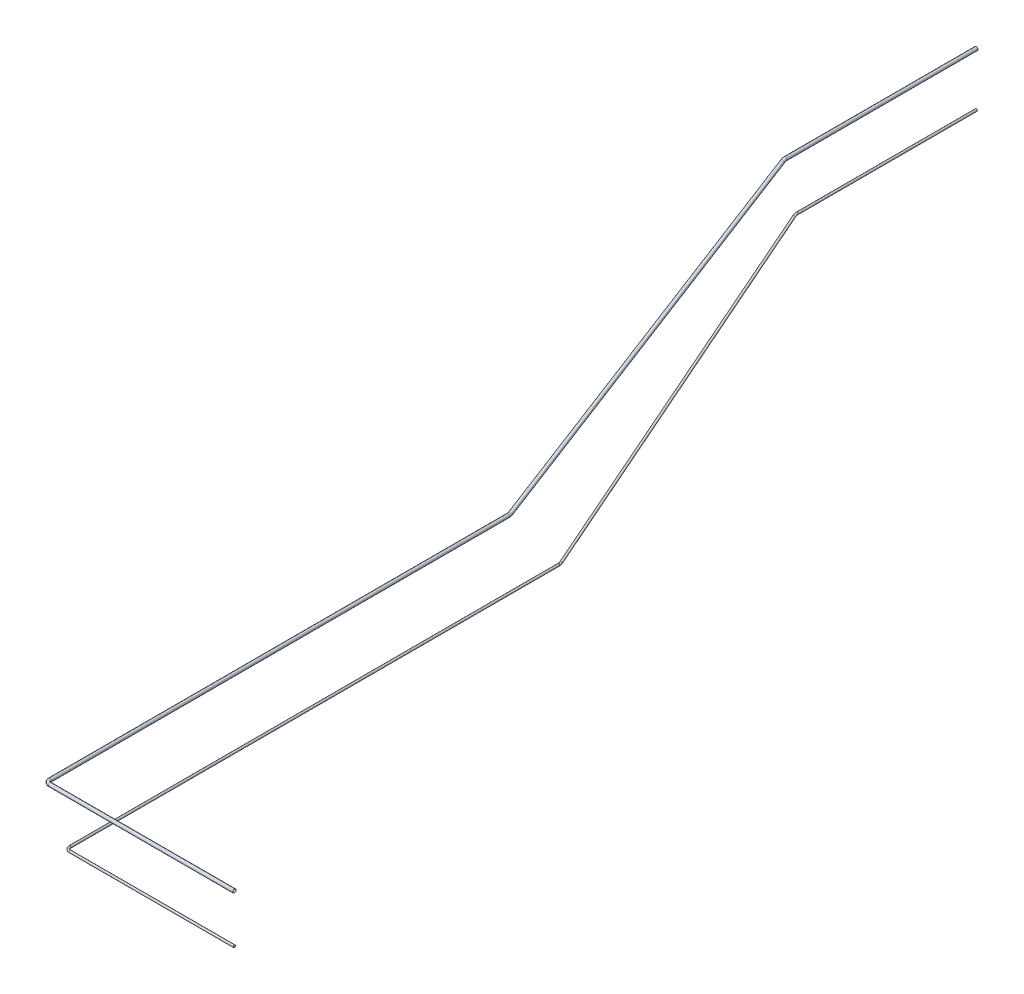
ISO-10303-21;
HEADER;
FILE_DESCRIPTION(('STEP AP214'),'2;1');
FILE_NAME('part.step','',(''),(''),'','','');
FILE_SCHEMA(('AUTOMOTIVE_DESIGN { 1 0 10303 214 1 1 1 1 }'));
ENDSEC;
DATA;
#1=APPLICATION_CONTEXT('core data for automotive mechanical design processes');
#2=APPLICATION_PROTOCOL_DEFINITION('international standard','automotive_design',2000,#1);
#3=PRODUCT_CONTEXT('',#1,'mechanical');
#4=PRODUCT('Part','Part','',(#3));
#5=PRODUCT_RELATED_PRODUCT_CATEGORY('part','',(#4));
#6=PRODUCT_DEFINITION_FORMATION('','',#4);
#7=PRODUCT_DEFINITION_CONTEXT('part definition',#1,'design');
#8=PRODUCT_DEFINITION('design','',#6,#7);
#9=PRODUCT_DEFINITION_SHAPE('','',#8);
#10=(LENGTH_UNIT() NAMED_UNIT(*) SI_UNIT(.MILLI.,.METRE.));
#11=(NAMED_UNIT(*) PLANE_ANGLE_UNIT() SI_UNIT($,.RADIAN.));
#12=(NAMED_UNIT(*) SI_UNIT($,.STERADIAN.) SOLID_ANGLE_UNIT());
#13=UNCERTAINTY_MEASURE_WITH_UNIT(LENGTH_MEASURE(1.E-05),#10,'distance_accuracy_value','');
#14=(GEOMETRIC_REPRESENTATION_CONTEXT(3) GLOBAL_UNCERTAINTY_ASSIGNED_CONTEXT((#13)) GLOBAL_UNIT_ASSIGNED_CONTEXT((#10,
#11,#12)) REPRESENTATION_CONTEXT('',''));
#15=CARTESIAN_POINT('',(0.,0.,0.));
#16=DIRECTION('',(0.,0.,1.));
#17=DIRECTION('',(1.,0.,0.));
#18=AXIS2_PLACEMENT_3D('',#15,#16,#17);
#19=CARTESIAN_POINT('',(0.,1100.,0.));
#20=DIRECTION('',(-1.,0.,0.));
#21=DIRECTION('',(0.,0.,1.));
#22=AXIS2_PLACEMENT_3D('',#19,#20,#21);
#23=CYLINDRICAL_SURFACE('',#22,21.2000000000001);
#24=CARTESIAN_POINT('',(-2309.67841768229,1100.,0.));
#25=DIRECTION('',(1.,0.,0.));
#26=DIRECTION('',(0.,0.,-1.));
#27=AXIS2_PLACEMENT_3D('',#24,#25,#26);
#28=CIRCLE('',#27,21.2000000000001);
#29=CARTESIAN_POINT('',(-2309.67841768229,1100.,21.2));
#30=VERTEX_POINT('',#29);
#31=EDGE_CURVE('E63',#30,#30,#28,.T.);
#32=ORIENTED_EDGE('',*,*,#31,.T.);
#33=EDGE_LOOP('',(#32));
#34=FACE_BOUND('',#33,.T.);
#35=CARTESIAN_POINT('',(0.,1100.,0.));
#36=DIRECTION('',(1.,0.,0.));
#37=DIRECTION('',(0.,0.,-1.));
#38=AXIS2_PLACEMENT_3D('',#35,#36,#37);
#39=CIRCLE('',#38,21.2000000000001);
#40=CARTESIAN_POINT('',(0.,1100.,-21.2000000000001));
#41=VERTEX_POINT('',#40);
#42=EDGE_CURVE('E60',#41,#41,#39,.T.);
#43=ORIENTED_EDGE('',*,*,#42,.F.);
#44=EDGE_LOOP('',(#43));
#45=FACE_BOUND('',#44,.T.);
#46=ADVANCED_FACE('F39',(#34,#45),#23,.T.);
#47=CARTESIAN_POINT('',(-2309.67841768229,1100.,-49.999999999999));
#48=DIRECTION('',(0.,-1.,0.));
#49=DIRECTION('',(0.,0.,-1.));
#50=AXIS2_PLACEMENT_3D('',#47,#48,#49);
#51=TOROIDAL_SURFACE('',#50,49.999999999999,21.2000000000001);
#52=CARTESIAN_POINT('',(-2359.67841768229,1100.,-49.999999999999));
#53=DIRECTION('',(0.,0.,1.));
#54=DIRECTION('',(1.,0.,0.));
#55=AXIS2_PLACEMENT_3D('',#52,#53,#54);
#56=CIRCLE('',#55,21.2000000000001);
#57=CARTESIAN_POINT('',(-2380.87841768229,1100.,-49.999999999999));
#58=VERTEX_POINT('',#57);
#59=EDGE_CURVE('E66',#58,#58,#56,.T.);
#60=CARTESIAN_POINT('',(-2309.67841768229,1100.,-49.999999999999));
#61=DIRECTION('',(0.,-1.,0.));
#62=DIRECTION('',(0.,0.,-1.));
#63=AXIS2_PLACEMENT_3D('',#60,#61,#62);
#64=CIRCLE('',#63,71.199999999999);
#65=EDGE_CURVE('',#30,#58,#64,.T.);
#66=ORIENTED_EDGE('',*,*,#31,.F.);
#67=ORIENTED_EDGE('',*,*,#59,.T.);
#68=ORIENTED_EDGE('',*,*,#65,.T.);
#69=ORIENTED_EDGE('',*,*,#65,.F.);
#70=EDGE_LOOP('',(#66,#68,#67,#69));
#71=FACE_BOUND('',#70,.T.);
#72=ADVANCED_FACE('F114',(#71),#51,.T.);
#73=CARTESIAN_POINT('',(-2359.67841768229,1100.,-49.999999999999));
#74=DIRECTION('',(0.,0.,-1.));
#75=DIRECTION('',(-1.,0.,0.));
#76=AXIS2_PLACEMENT_3D('',#73,#74,#75);
#77=CYLINDRICAL_SURFACE('',#76,21.2000000000001);
#78=CARTESIAN_POINT('',(-2359.67841768229,1100.,-5790.1992075167));
#79=DIRECTION('',(0.,0.,1.));
#80=DIRECTION('',(1.,0.,0.));
#81=AXIS2_PLACEMENT_3D('',#78,#79,#80);
#82=CIRCLE('',#81,21.2000000000001);
#83=CARTESIAN_POINT('',(-2361.89767119377,1078.91647766971,-5790.1992075167));
#84=VERTEX_POINT('',#83);
#85=EDGE_CURVE('E69',#84,#84,#82,.T.);
#86=ORIENTED_EDGE('',*,*,#85,.T.);
#87=EDGE_LOOP('',(#86));
#88=FACE_BOUND('',#87,.T.);
#89=ORIENTED_EDGE('',*,*,#59,.F.);
#90=EDGE_LOOP('',(#89));
#91=FACE_BOUND('',#90,.T.);
#92=ADVANCED_FACE('F118',(#88,#91),#77,.T.);
#93=CARTESIAN_POINT('',(-2354.44432921183,1149.72528851483,-5790.1992075167));
#94=DIRECTION('',(0.994505770296653,-0.104681769409292,0.));
#95=DIRECTION('',(0.104681769409292,0.994505770296654,0.));
#96=AXIS2_PLACEMENT_3D('',#93,#94,#95);
#97=TOROIDAL_SURFACE('',#96,49.9999999999989,21.2000000000001);
#98=CARTESIAN_POINT('',(-2358.62714979775,1109.9873357434,-5820.2558061513));
#99=DIRECTION('',(-0.0629275585498898,-0.59782921555194,0.799149767820465));
#100=DIRECTION('',(0.997799028354462,-0.0209098395460724,0.0629275585498897));
#101=AXIS2_PLACEMENT_3D('',#98,#99,#100);
#102=CIRCLE('',#101,21.2000000000001);
#103=CARTESIAN_POINT('',(-2360.40066572618,1093.13844376831,-5832.99980397237));
#104=VERTEX_POINT('',#103);
#105=EDGE_CURVE('E72',#104,#104,#102,.T.);
#106=CARTESIAN_POINT('',(-2354.44432921183,1149.72528851483,-5790.1992075167));
#107=DIRECTION('',(0.994505770296653,-0.104681769409292,0.));
#108=DIRECTION('',(0.104681769409292,0.994505770296654,0.));
#109=AXIS2_PLACEMENT_3D('',#106,#107,#108);
#110=CIRCLE('',#109,71.199999999999);
#111=EDGE_CURVE('',#84,#104,#110,.T.);
#112=ORIENTED_EDGE('',*,*,#85,.F.);
#113=ORIENTED_EDGE('',*,*,#105,.T.);
#114=ORIENTED_EDGE('',*,*,#111,.T.);
#115=ORIENTED_EDGE('',*,*,#111,.F.);
#116=EDGE_LOOP('',(#112,#114,#113,#115));
#117=FACE_BOUND('',#116,.T.);
#118=ADVANCED_FACE('F122',(#117),#97,.T.);
#119=CARTESIAN_POINT('',(-2358.62714979775,1109.9873357434,-5820.2558061513));
#120=DIRECTION('',(0.0629275585498901,0.597829215551933,-0.799149767820469));
#121=DIRECTION('',(0.,0.800736750213241,0.599016407836995));
#122=AXIS2_PLACEMENT_3D('',#119,#120,#121);
#123=CYLINDRICAL_SURFACE('',#122,21.2000000000001);
#124=CARTESIAN_POINT('',(-2109.70136053603,3474.85120070642,-8981.49376416481));
#125=DIRECTION('',(-0.0629275585498901,-0.597829215551933,0.79914976782047));
#126=DIRECTION('',(0.997799028354462,-0.0209098395460725,0.0629275585498899));
#127=AXIS2_PLACEMENT_3D('',#124,#125,#126);
#128=CIRCLE('',#127,21.2000000000001);
#129=CARTESIAN_POINT('',(-2107.9278446076,3491.70009268151,-8968.74976634374));
#130=VERTEX_POINT('',#129);
#131=EDGE_CURVE('E74',#130,#130,#128,.T.);
#132=ORIENTED_EDGE('',*,*,#131,.T.);
#133=EDGE_LOOP('',(#132));
#134=FACE_BOUND('',#133,.T.);
#135=ORIENTED_EDGE('',*,*,#105,.F.);
#136=EDGE_LOOP('',(#135));
#137=FACE_BOUND('',#136,.T.);
#138=ADVANCED_FACE('F94',(#134,#137),#123,.T.);
#139=CARTESIAN_POINT('',(-2113.88418112195,3435.11324793498,-9011.5503627994));
#140=DIRECTION('',(-0.994505770296653,0.104681769409293,0.));
#141=DIRECTION('',(-0.104681769409293,-0.994505770296653,0.));
#142=AXIS2_PLACEMENT_3D('',#139,#140,#141);
#143=TOROIDAL_SURFACE('',#142,49.9999999999987,21.2000000000001);
#144=CARTESIAN_POINT('',(-2108.65009265149,3484.83853644981,-9011.5503627994));
#145=DIRECTION('',(0.,0.,1.));
#146=DIRECTION('',(1.,0.,0.));
#147=AXIS2_PLACEMENT_3D('',#144,#145,#146);
#148=CIRCLE('',#147,21.2000000000001);
#149=CARTESIAN_POINT('',(-2106.43083914001,3505.9220587801,-9011.5503627994));
#150=VERTEX_POINT('',#149);
#151=EDGE_CURVE('E43',#150,#150,#148,.T.);
#152=CARTESIAN_POINT('',(-2113.88418112195,3435.11324793498,-9011.5503627994));
#153=DIRECTION('',(-0.994505770296653,0.104681769409293,0.));
#154=DIRECTION('',(-0.104681769409293,-0.994505770296653,0.));
#155=AXIS2_PLACEMENT_3D('',#152,#153,#154);
#156=CIRCLE('',#155,71.1999999999988);
#157=EDGE_CURVE('',#130,#150,#156,.T.);
#158=ORIENTED_EDGE('',*,*,#131,.F.);
#159=ORIENTED_EDGE('',*,*,#151,.T.);
#160=ORIENTED_EDGE('',*,*,#157,.T.);
#161=ORIENTED_EDGE('',*,*,#157,.F.);
#162=EDGE_LOOP('',(#158,#160,#159,#161));
#163=FACE_BOUND('',#162,.T.);
#164=ADVANCED_FACE('F81',(#163),#143,.T.);
#165=CARTESIAN_POINT('',(-2108.65009265149,3484.83853644981,-9011.5503627994));
#166=DIRECTION('',(0.,0.,-1.));
#167=DIRECTION('',(0.,1.,0.));
#168=AXIS2_PLACEMENT_3D('',#165,#166,#167);
#169=CYLINDRICAL_SURFACE('',#168,21.2000000000001);
#170=CARTESIAN_POINT('',(-2108.65009265149,3484.83853644981,-11402.4084146265));
#171=DIRECTION('',(0.,0.,1.));
#172=DIRECTION('',(1.,0.,0.));
#173=AXIS2_PLACEMENT_3D('',#170,#171,#172);
#174=CIRCLE('',#173,21.2000000000001);
#175=CARTESIAN_POINT('',(-2087.45009265149,3484.83853644981,-11402.4084146265));
#176=VERTEX_POINT('',#175);
#177=EDGE_CURVE('E56',#176,#176,#174,.T.);
#178=ORIENTED_EDGE('',*,*,#177,.T.);
#179=EDGE_LOOP('',(#178));
#180=FACE_BOUND('',#179,.T.);
#181=ORIENTED_EDGE('',*,*,#151,.F.);
#182=EDGE_LOOP('',(#181));
#183=FACE_BOUND('',#182,.T.);
#184=ADVANCED_FACE('F41',(#180,#183),#169,.T.);
#185=CARTESIAN_POINT('',(0.,1100.,0.));
#186=DIRECTION('',(1.,0.,0.));
#187=DIRECTION('',(0.,0.,-1.));
#188=AXIS2_PLACEMENT_3D('',#185,#186,#187);
#189=PLANE('',#188);
#190=CARTESIAN_POINT('',(0.,1100.,0.));
#191=DIRECTION('',(1.,0.,0.));
#192=DIRECTION('',(0.,0.,-1.));
#193=AXIS2_PLACEMENT_3D('',#190,#191,#192);
#194=CIRCLE('',#193,18.7);
#195=CARTESIAN_POINT('',(0.,1100.,-18.7));
#196=VERTEX_POINT('',#195);
#197=EDGE_CURVE('E59',#196,#196,#194,.F.);
#198=ORIENTED_EDGE('',*,*,#197,.T.);
#199=EDGE_LOOP('',(#198));
#200=FACE_BOUND('',#199,.T.);
#201=ORIENTED_EDGE('',*,*,#42,.T.);
#202=EDGE_LOOP('',(#201));
#203=FACE_BOUND('',#202,.T.);
#204=ADVANCED_FACE('F85',(#200,#203),#189,.T.);
#205=CARTESIAN_POINT('',(-2108.65009265149,3484.83853644981,-11402.4084146265));
#206=DIRECTION('',(0.,0.,1.));
#207=DIRECTION('',(1.,0.,0.));
#208=AXIS2_PLACEMENT_3D('',#205,#206,#207);
#209=PLANE('',#208);
#210=CARTESIAN_POINT('',(-2108.65009265149,3484.83853644981,-11402.4084146265));
#211=DIRECTION('',(0.,0.,1.));
#212=DIRECTION('',(1.,0.,0.));
#213=AXIS2_PLACEMENT_3D('',#210,#211,#212);
#214=CIRCLE('',#213,18.7);
#215=CARTESIAN_POINT('',(-2089.95009265149,3484.83853644981,-11402.4084146265));
#216=VERTEX_POINT('',#215);
#217=EDGE_CURVE('E11',#216,#216,#214,.F.);
#218=ORIENTED_EDGE('',*,*,#217,.F.);
#219=EDGE_LOOP('',(#218));
#220=FACE_BOUND('',#219,.T.);
#221=ORIENTED_EDGE('',*,*,#177,.F.);
#222=EDGE_LOOP('',(#221));
#223=FACE_BOUND('',#222,.T.);
#224=ADVANCED_FACE('F91',(#220,#223),#209,.F.);
#225=CARTESIAN_POINT('',(0.,1100.,0.));
#226=DIRECTION('',(-1.,0.,0.));
#227=DIRECTION('',(0.,0.,1.));
#228=AXIS2_PLACEMENT_3D('',#225,#226,#227);
#229=CYLINDRICAL_SURFACE('',#228,18.7);
#230=CARTESIAN_POINT('',(-2309.67841768229,1100.,0.));
#231=DIRECTION('',(1.,0.,0.));
#232=DIRECTION('',(0.,0.,-1.));
#233=AXIS2_PLACEMENT_3D('',#230,#231,#232);
#234=CIRCLE('',#233,18.7);
#235=CARTESIAN_POINT('',(-2309.67841768229,1100.,18.7));
#236=VERTEX_POINT('',#235);
#237=EDGE_CURVE('E238',#236,#236,#234,.F.);
#238=ORIENTED_EDGE('',*,*,#237,.T.);
#239=EDGE_LOOP('',(#238));
#240=FACE_BOUND('',#239,.T.);
#241=ORIENTED_EDGE('',*,*,#197,.F.);
#242=EDGE_LOOP('',(#241));
#243=FACE_BOUND('',#242,.T.);
#244=ADVANCED_FACE('F109',(#240,#243),#229,.F.);
#245=CARTESIAN_POINT('',(-2309.67841768229,1100.,-49.999999999999));
#246=DIRECTION('',(0.,-1.,0.));
#247=DIRECTION('',(0.,0.,-1.));
#248=AXIS2_PLACEMENT_3D('',#245,#246,#247);
#249=TOROIDAL_SURFACE('',#248,49.999999999999,18.7);
#250=CARTESIAN_POINT('',(-2359.67841768229,1100.,-49.999999999999));
#251=DIRECTION('',(0.,0.,1.));
#252=DIRECTION('',(1.,0.,0.));
#253=AXIS2_PLACEMENT_3D('',#250,#251,#252);
#254=CIRCLE('',#253,18.7);
#255=CARTESIAN_POINT('',(-2378.37841768229,1100.,-49.999999999999));
#256=VERTEX_POINT('',#255);
#257=EDGE_CURVE('E233',#256,#256,#254,.F.);
#258=CARTESIAN_POINT('',(-2309.67841768229,1100.,-49.999999999999));
#259=DIRECTION('',(0.,-1.,0.));
#260=DIRECTION('',(0.,0.,-1.));
#261=AXIS2_PLACEMENT_3D('',#258,#259,#260);
#262=CIRCLE('',#261,68.699999999999);
#263=EDGE_CURVE('',#236,#256,#262,.T.);
#264=ORIENTED_EDGE('',*,*,#237,.F.);
#265=ORIENTED_EDGE('',*,*,#257,.T.);
#266=ORIENTED_EDGE('',*,*,#263,.T.);
#267=ORIENTED_EDGE('',*,*,#263,.F.);
#268=EDGE_LOOP('',(#264,#266,#265,#267));
#269=FACE_BOUND('',#268,.T.);
#270=ADVANCED_FACE('F172',(#269),#249,.F.);
#271=CARTESIAN_POINT('',(-2359.67841768229,1100.,-49.999999999999));
#272=DIRECTION('',(0.,0.,-1.));
#273=DIRECTION('',(-1.,0.,0.));
#274=AXIS2_PLACEMENT_3D('',#271,#272,#273);
#275=CYLINDRICAL_SURFACE('',#274,18.7);
#276=CARTESIAN_POINT('',(-2359.67841768229,1100.,-5790.1992075167));
#277=DIRECTION('',(0.,0.,1.));
#278=DIRECTION('',(1.,0.,0.));
#279=AXIS2_PLACEMENT_3D('',#276,#277,#278);
#280=CIRCLE('',#279,18.7);
#281=CARTESIAN_POINT('',(-2361.63596677024,1081.40274209545,-5790.1992075167));
#282=VERTEX_POINT('',#281);
#283=EDGE_CURVE('E230',#282,#282,#280,.F.);
#284=ORIENTED_EDGE('',*,*,#283,.T.);
#285=EDGE_LOOP('',(#284));
#286=FACE_BOUND('',#285,.T.);
#287=ORIENTED_EDGE('',*,*,#257,.F.);
#288=EDGE_LOOP('',(#287));
#289=FACE_BOUND('',#288,.T.);
#290=ADVANCED_FACE('F182',(#286,#289),#275,.F.);
#291=CARTESIAN_POINT('',(-2354.44432921183,1149.72528851483,-5790.1992075167));
#292=DIRECTION('',(0.994505770296653,-0.104681769409292,0.));
#293=DIRECTION('',(0.104681769409292,0.994505770296654,0.));
#294=AXIS2_PLACEMENT_3D('',#291,#292,#293);
#295=TOROIDAL_SURFACE('',#294,49.9999999999989,18.7);
#296=CARTESIAN_POINT('',(-2358.62714979775,1109.9873357434,-5820.2558061513));
#297=DIRECTION('',(-0.0629275585498898,-0.59782921555194,0.799149767820465));
#298=DIRECTION('',(0.997799028354462,-0.0209098395460724,0.0629275585498897));
#299=AXIS2_PLACEMENT_3D('',#296,#297,#298);
#300=CIRCLE('',#299,18.7);
#301=CARTESIAN_POINT('',(-2360.19152469688,1095.12534140688,-5831.49697404063));
#302=VERTEX_POINT('',#301);
#303=EDGE_CURVE('E229',#302,#302,#300,.F.);
#304=CARTESIAN_POINT('',(-2354.44432921183,1149.72528851483,-5790.1992075167));
#305=DIRECTION('',(0.994505770296653,-0.104681769409292,0.));
#306=DIRECTION('',(0.104681769409292,0.994505770296654,0.));
#307=AXIS2_PLACEMENT_3D('',#304,#305,#306);
#308=CIRCLE('',#307,68.699999999999);
#309=EDGE_CURVE('',#282,#302,#308,.T.);
#310=ORIENTED_EDGE('',*,*,#283,.F.);
#311=ORIENTED_EDGE('',*,*,#303,.T.);
#312=ORIENTED_EDGE('',*,*,#309,.T.);
#313=ORIENTED_EDGE('',*,*,#309,.F.);
#314=EDGE_LOOP('',(#310,#312,#311,#313));
#315=FACE_BOUND('',#314,.T.);
#316=ADVANCED_FACE('F192',(#315),#295,.F.);
#317=CARTESIAN_POINT('',(-2358.62714979775,1109.9873357434,-5820.2558061513));
#318=DIRECTION('',(0.0629275585498901,0.597829215551933,-0.799149767820469));
#319=DIRECTION('',(0.,0.800736750213241,0.599016407836995));
#320=AXIS2_PLACEMENT_3D('',#317,#318,#319);
#321=CYLINDRICAL_SURFACE('',#320,18.7);
#322=CARTESIAN_POINT('',(-2109.70136053603,3474.85120070642,-8981.49376416481));
#323=DIRECTION('',(-0.0629275585498901,-0.597829215551933,0.79914976782047));
#324=DIRECTION('',(0.997799028354462,-0.0209098395460725,0.0629275585498899));
#325=AXIS2_PLACEMENT_3D('',#322,#323,#324);
#326=CIRCLE('',#325,18.7);
#327=CARTESIAN_POINT('',(-2108.13698563689,3489.71319504293,-8970.25259627547));
#328=VERTEX_POINT('',#327);
#329=EDGE_CURVE('E52',#328,#328,#326,.F.);
#330=ORIENTED_EDGE('',*,*,#329,.T.);
#331=EDGE_LOOP('',(#330));
#332=FACE_BOUND('',#331,.T.);
#333=ORIENTED_EDGE('',*,*,#303,.F.);
#334=EDGE_LOOP('',(#333));
#335=FACE_BOUND('',#334,.T.);
#336=ADVANCED_FACE('F102',(#332,#335),#321,.F.);
#337=CARTESIAN_POINT('',(-2113.88418112195,3435.11324793498,-9011.5503627994));
#338=DIRECTION('',(-0.994505770296653,0.104681769409293,0.));
#339=DIRECTION('',(-0.104681769409293,-0.994505770296653,0.));
#340=AXIS2_PLACEMENT_3D('',#337,#338,#339);
#341=TOROIDAL_SURFACE('',#340,49.9999999999987,18.7);
#342=CARTESIAN_POINT('',(-2108.65009265149,3484.83853644981,-9011.5503627994));
#343=DIRECTION('',(0.,0.,1.));
#344=DIRECTION('',(1.,0.,0.));
#345=AXIS2_PLACEMENT_3D('',#342,#343,#344);
#346=CIRCLE('',#345,18.7);
#347=CARTESIAN_POINT('',(-2106.69254356354,3503.43579435436,-9011.5503627994));
#348=VERTEX_POINT('',#347);
#349=EDGE_CURVE('E47',#348,#348,#346,.F.);
#350=CARTESIAN_POINT('',(-2113.88418112195,3435.11324793498,-9011.5503627994));
#351=DIRECTION('',(-0.994505770296653,0.104681769409293,0.));
#352=DIRECTION('',(-0.104681769409293,-0.994505770296653,0.));
#353=AXIS2_PLACEMENT_3D('',#350,#351,#352);
#354=CIRCLE('',#353,68.6999999999988);
#355=EDGE_CURVE('',#328,#348,#354,.T.);
#356=ORIENTED_EDGE('',*,*,#329,.F.);
#357=ORIENTED_EDGE('',*,*,#349,.T.);
#358=ORIENTED_EDGE('',*,*,#355,.T.);
#359=ORIENTED_EDGE('',*,*,#355,.F.);
#360=EDGE_LOOP('',(#356,#358,#357,#359));
#361=FACE_BOUND('',#360,.T.);
#362=ADVANCED_FACE('F97',(#361),#341,.F.);
#363=CARTESIAN_POINT('',(-2108.65009265149,3484.83853644981,-9011.5503627994));
#364=DIRECTION('',(0.,0.,-1.));
#365=DIRECTION('',(0.,1.,0.));
#366=AXIS2_PLACEMENT_3D('',#363,#364,#365);
#367=CYLINDRICAL_SURFACE('',#366,18.7);
#368=ORIENTED_EDGE('',*,*,#217,.T.);
#369=EDGE_LOOP('',(#368));
#370=FACE_BOUND('',#369,.T.);
#371=ORIENTED_EDGE('',*,*,#349,.F.);
#372=EDGE_LOOP('',(#371));
#373=FACE_BOUND('',#372,.T.);
#374=ADVANCED_FACE('F95',(#370,#373),#367,.F.);
#375=CLOSED_SHELL('',(#46,#72,#92,#118,#138,#164,#184,#204,#224,#244,#270,#290,#316,#336,#362,#374));
#376=MANIFOLD_SOLID_BREP('B2',#375);
#377=CARTESIAN_POINT('',(-2108.65009265149,2817.88503665905,-9154.82656363667));
#378=DIRECTION('',(0.,0.,-1.));
#379=DIRECTION('',(-1.,0.,0.));
#380=AXIS2_PLACEMENT_3D('',#377,#378,#379);
#381=CYLINDRICAL_SURFACE('',#380,13.45);
#382=CARTESIAN_POINT('',(-2108.65009265149,2817.88503665905,-9154.82656363667));
#383=DIRECTION('',(0.,0.,1.));
#384=DIRECTION('',(1.,0.,0.));
#385=AXIS2_PLACEMENT_3D('',#382,#383,#384);
#386=CIRCLE('',#385,13.45);
#387=CARTESIAN_POINT('',(-2108.65009265149,2831.33503665905,-9154.82656363667));
#388=VERTEX_POINT('',#387);
#389=EDGE_CURVE('E291',#388,#388,#386,.T.);
#390=ORIENTED_EDGE('',*,*,#389,.F.);
#391=EDGE_LOOP('',(#390));
#392=FACE_BOUND('',#391,.T.);
#393=CARTESIAN_POINT('',(-2108.65009265149,2817.88503665905,-11402.4084146265));
#394=DIRECTION('',(0.,0.,1.));
#395=DIRECTION('',(1.,0.,0.));
#396=AXIS2_PLACEMENT_3D('',#393,#394,#395);
#397=CIRCLE('',#396,13.45);
#398=CARTESIAN_POINT('',(-2095.20009265149,2817.88503665905,-11402.4084146265));
#399=VERTEX_POINT('',#398);
#400=EDGE_CURVE('E38',#399,#399,#397,.T.);
#401=ORIENTED_EDGE('',*,*,#400,.T.);
#402=EDGE_LOOP('',(#401));
#403=FACE_BOUND('',#402,.T.);
#404=ADVANCED_FACE('F281',(#392,#403),#381,.T.);
#405=CARTESIAN_POINT('',(-2108.65009265149,2817.88503665905,-9154.82656363667));
#406=DIRECTION('',(0.,0.,-1.));
#407=DIRECTION('',(-1.,0.,0.));
#408=AXIS2_PLACEMENT_3D('',#405,#406,#407);
#409=CYLINDRICAL_SURFACE('',#408,10.95);
#410=CARTESIAN_POINT('',(-2108.65009265149,2817.88503665905,-9154.82656363667));
#411=DIRECTION('',(0.,0.,1.));
#412=DIRECTION('',(1.,0.,0.));
#413=AXIS2_PLACEMENT_3D('',#410,#411,#412);
#414=CIRCLE('',#413,10.95);
#415=CARTESIAN_POINT('',(-2108.65009265149,2828.83503665905,-9154.82656363667));
#416=VERTEX_POINT('',#415);
#417=EDGE_CURVE('E295',#416,#416,#414,.T.);
#418=ORIENTED_EDGE('',*,*,#417,.T.);
#419=EDGE_LOOP('',(#418));
#420=FACE_BOUND('',#419,.T.);
#421=CARTESIAN_POINT('',(-2108.65009265149,2817.88503665905,-11402.4084146265));
#422=DIRECTION('',(0.,0.,1.));
#423=DIRECTION('',(1.,0.,0.));
#424=AXIS2_PLACEMENT_3D('',#421,#422,#423);
#425=CIRCLE('',#424,10.95);
#426=CARTESIAN_POINT('',(-2097.70009265149,2817.88503665905,-11402.4084146265));
#427=VERTEX_POINT('',#426);
#428=EDGE_CURVE('E287',#427,#427,#425,.T.);
#429=ORIENTED_EDGE('',*,*,#428,.F.);
#430=EDGE_LOOP('',(#429));
#431=FACE_BOUND('',#430,.T.);
#432=ADVANCED_FACE('F362',(#420,#431),#409,.F.);
#433=CARTESIAN_POINT('',(-2108.65009265149,2767.88503665905,-9154.82656363667));
#434=DIRECTION('',(-1.,0.,0.));
#435=DIRECTION('',(0.,0.,1.));
#436=AXIS2_PLACEMENT_3D('',#433,#434,#435);
#437=TOROIDAL_SURFACE('',#436,49.9999999999997,13.45);
#438=CARTESIAN_POINT('',(-2108.65009265149,2807.18815621119,-9123.91920539514));
#439=DIRECTION('',(0.,-0.618147164830597,0.786062391042782));
#440=DIRECTION('',(1.,0.,0.));
#441=AXIS2_PLACEMENT_3D('',#438,#439,#440);
#442=CIRCLE('',#441,13.45);
#443=CARTESIAN_POINT('',(-2108.65009265149,2817.76069537071,-9115.60512602817));
#444=VERTEX_POINT('',#443);
#445=EDGE_CURVE('E300',#444,#444,#442,.T.);
#446=CARTESIAN_POINT('',(-2108.65009265149,2767.88503665905,-9154.82656363667));
#447=DIRECTION('',(-1.,0.,0.));
#448=DIRECTION('',(0.,0.,1.));
#449=AXIS2_PLACEMENT_3D('',#446,#447,#448);
#450=CIRCLE('',#449,63.4499999999997);
#451=EDGE_CURVE('',#444,#388,#450,.T.);
#452=ORIENTED_EDGE('',*,*,#445,.F.);
#453=ORIENTED_EDGE('',*,*,#389,.T.);
#454=ORIENTED_EDGE('',*,*,#451,.T.);
#455=ORIENTED_EDGE('',*,*,#451,.F.);
#456=EDGE_LOOP('',(#452,#454,#453,#455));
#457=FACE_BOUND('',#456,.T.);
#458=ADVANCED_FACE('F367',(#457),#437,.T.);
#459=CARTESIAN_POINT('',(-2108.65009265149,2767.88503665905,-9154.82656363667));
#460=DIRECTION('',(-1.,0.,0.));
#461=DIRECTION('',(0.,0.,1.));
#462=AXIS2_PLACEMENT_3D('',#459,#460,#461);
#463=TOROIDAL_SURFACE('',#462,49.9999999999997,10.95);
#464=CARTESIAN_POINT('',(-2108.65009265149,2807.18815621119,-9123.91920539514));
#465=DIRECTION('',(0.,-0.618147164830597,0.786062391042782));
#466=DIRECTION('',(1.,0.,0.));
#467=AXIS2_PLACEMENT_3D('',#464,#465,#466);
#468=CIRCLE('',#467,10.95);
#469=CARTESIAN_POINT('',(-2108.65009265149,2815.79553939311,-9117.15049394024));
#470=VERTEX_POINT('',#469);
#471=EDGE_CURVE('E303',#470,#470,#468,.T.);
#472=CARTESIAN_POINT('',(-2108.65009265149,2767.88503665905,-9154.82656363667));
#473=DIRECTION('',(-1.,0.,0.));
#474=DIRECTION('',(0.,0.,1.));
#475=AXIS2_PLACEMENT_3D('',#472,#473,#474);
#476=CIRCLE('',#475,60.9499999999997);
#477=EDGE_CURVE('',#470,#416,#476,.T.);
#478=ORIENTED_EDGE('',*,*,#471,.T.);
#479=ORIENTED_EDGE('',*,*,#417,.F.);
#480=ORIENTED_EDGE('',*,*,#477,.T.);
#481=ORIENTED_EDGE('',*,*,#477,.F.);
#482=EDGE_LOOP('',(#478,#480,#479,#481));
#483=FACE_BOUND('',#482,.T.);
#484=ADVANCED_FACE('F372',(#483),#463,.F.);
#485=CARTESIAN_POINT('',(-2108.65009265149,510.696880447866,-6203.60261099629));
#486=DIRECTION('',(0.,0.6181471648306,-0.786062391042779));
#487=DIRECTION('',(0.,0.786062391042779,0.6181471648306));
#488=AXIS2_PLACEMENT_3D('',#485,#486,#487);
#489=CYLINDRICAL_SURFACE('',#488,13.45);
#490=CARTESIAN_POINT('',(-2108.65009265149,510.696880447866,-6203.60261099629));
#491=DIRECTION('',(0.,-0.618147164830597,0.786062391042782));
#492=DIRECTION('',(1.,0.,0.));
#493=AXIS2_PLACEMENT_3D('',#490,#491,#492);
#494=CIRCLE('',#493,13.45);
#495=CARTESIAN_POINT('',(-2108.65009265149,500.124341288341,-6211.91669036326));
#496=VERTEX_POINT('',#495);
#497=EDGE_CURVE('E306',#496,#496,#494,.T.);
#498=ORIENTED_EDGE('',*,*,#497,.F.);
#499=EDGE_LOOP('',(#498));
#500=FACE_BOUND('',#499,.T.);
#501=ORIENTED_EDGE('',*,*,#445,.T.);
#502=EDGE_LOOP('',(#501));
#503=FACE_BOUND('',#502,.T.);
#504=ADVANCED_FACE('F378',(#500,#503),#489,.T.);
#505=CARTESIAN_POINT('',(-2108.65009265149,510.696880447866,-6203.60261099629));
#506=DIRECTION('',(0.,0.6181471648306,-0.786062391042779));
#507=DIRECTION('',(0.,0.786062391042779,0.6181471648306));
#508=AXIS2_PLACEMENT_3D('',#505,#506,#507);
#509=CYLINDRICAL_SURFACE('',#508,10.95);
#510=CARTESIAN_POINT('',(-2108.65009265149,510.696880447866,-6203.60261099629));
#511=DIRECTION('',(0.,-0.618147164830597,0.786062391042782));
#512=DIRECTION('',(1.,0.,0.));
#513=AXIS2_PLACEMENT_3D('',#510,#511,#512);
#514=CIRCLE('',#513,10.95);
#515=CARTESIAN_POINT('',(-2108.65009265149,502.089497265948,-6210.37132245119));
#516=VERTEX_POINT('',#515);
#517=EDGE_CURVE('E309',#516,#516,#514,.T.);
#518=ORIENTED_EDGE('',*,*,#517,.T.);
#519=EDGE_LOOP('',(#518));
#520=FACE_BOUND('',#519,.T.);
#521=ORIENTED_EDGE('',*,*,#471,.F.);
#522=EDGE_LOOP('',(#521));
#523=FACE_BOUND('',#522,.T.);
#524=ADVANCED_FACE('F385',(#520,#523),#509,.F.);
#525=CARTESIAN_POINT('',(-2108.65009265149,550.000000000006,-6172.69525275476));
#526=DIRECTION('',(1.,0.,0.));
#527=DIRECTION('',(0.,0.,-1.));
#528=AXIS2_PLACEMENT_3D('',#525,#526,#527);
#529=TOROIDAL_SURFACE('',#528,50.,13.45);
#530=CARTESIAN_POINT('',(-2108.65009265149,500.000000000006,-6172.69525275476));
#531=DIRECTION('',(0.,0.,1.));
#532=DIRECTION('',(1.,0.,0.));
#533=AXIS2_PLACEMENT_3D('',#530,#531,#532);
#534=CIRCLE('',#533,13.45);
#535=CARTESIAN_POINT('',(-2108.65009265149,486.550000000006,-6172.69525275476));
#536=VERTEX_POINT('',#535);
#537=EDGE_CURVE('E312',#536,#536,#534,.T.);
#538=CARTESIAN_POINT('',(-2108.65009265149,550.000000000006,-6172.69525275476));
#539=DIRECTION('',(1.,0.,0.));
#540=DIRECTION('',(0.,0.,-1.));
#541=AXIS2_PLACEMENT_3D('',#538,#539,#540);
#542=CIRCLE('',#541,63.4500000000001);
#543=EDGE_CURVE('',#536,#496,#542,.T.);
#544=ORIENTED_EDGE('',*,*,#537,.F.);
#545=ORIENTED_EDGE('',*,*,#497,.T.);
#546=ORIENTED_EDGE('',*,*,#543,.T.);
#547=ORIENTED_EDGE('',*,*,#543,.F.);
#548=EDGE_LOOP('',(#544,#546,#545,#547));
#549=FACE_BOUND('',#548,.T.);
#550=ADVANCED_FACE('F389',(#549),#529,.T.);
#551=CARTESIAN_POINT('',(-2108.65009265149,550.000000000006,-6172.69525275476));
#552=DIRECTION('',(1.,0.,0.));
#553=DIRECTION('',(0.,0.,-1.));
#554=AXIS2_PLACEMENT_3D('',#551,#552,#553);
#555=TOROIDAL_SURFACE('',#554,50.,10.95);
#556=CARTESIAN_POINT('',(-2108.65009265149,500.000000000006,-6172.69525275476));
#557=DIRECTION('',(0.,0.,1.));
#558=DIRECTION('',(1.,0.,0.));
#559=AXIS2_PLACEMENT_3D('',#556,#557,#558);
#560=CIRCLE('',#559,10.95);
#561=CARTESIAN_POINT('',(-2108.65009265149,489.050000000006,-6172.69525275476));
#562=VERTEX_POINT('',#561);
#563=EDGE_CURVE('E315',#562,#562,#560,.T.);
#564=CARTESIAN_POINT('',(-2108.65009265149,550.000000000006,-6172.69525275476));
#565=DIRECTION('',(1.,0.,0.));
#566=DIRECTION('',(0.,0.,-1.));
#567=AXIS2_PLACEMENT_3D('',#564,#565,#566);
#568=CIRCLE('',#567,60.9500000000001);
#569=EDGE_CURVE('',#562,#516,#568,.T.);
#570=ORIENTED_EDGE('',*,*,#563,.T.);
#571=ORIENTED_EDGE('',*,*,#517,.F.);
#572=ORIENTED_EDGE('',*,*,#569,.T.);
#573=ORIENTED_EDGE('',*,*,#569,.F.);
#574=EDGE_LOOP('',(#570,#572,#571,#573));
#575=FACE_BOUND('',#574,.T.);
#576=ADVANCED_FACE('F393',(#575),#555,.F.);
#577=CARTESIAN_POINT('',(-2108.65009265149,500.000000000003,-49.9999999999998));
#578=DIRECTION('',(0.,0.,-1.));
#579=DIRECTION('',(0.,1.,0.));
#580=AXIS2_PLACEMENT_3D('',#577,#578,#579);
#581=CYLINDRICAL_SURFACE('',#580,13.45);
#582=CARTESIAN_POINT('',(-2108.65009265149,500.000000000003,-49.9999999999998));
#583=DIRECTION('',(0.,0.,1.));
#584=DIRECTION('',(1.,0.,0.));
#585=AXIS2_PLACEMENT_3D('',#582,#583,#584);
#586=CIRCLE('',#585,13.45);
#587=CARTESIAN_POINT('',(-2122.10009265149,500.000000000003,-49.9999999999998));
#588=VERTEX_POINT('',#587);
#589=EDGE_CURVE('E318',#588,#588,#586,.T.);
#590=ORIENTED_EDGE('',*,*,#589,.F.);
#591=EDGE_LOOP('',(#590));
#592=FACE_BOUND('',#591,.T.);
#593=ORIENTED_EDGE('',*,*,#537,.T.);
#594=EDGE_LOOP('',(#593));
#595=FACE_BOUND('',#594,.T.);
#596=ADVANCED_FACE('F397',(#592,#595),#581,.T.);
#597=CARTESIAN_POINT('',(-2108.65009265149,500.000000000003,-49.9999999999998));
#598=DIRECTION('',(0.,0.,-1.));
#599=DIRECTION('',(0.,1.,0.));
#600=AXIS2_PLACEMENT_3D('',#597,#598,#599);
#601=CYLINDRICAL_SURFACE('',#600,10.95);
#602=CARTESIAN_POINT('',(-2108.65009265149,500.000000000003,-49.9999999999998));
#603=DIRECTION('',(0.,0.,1.));
#604=DIRECTION('',(1.,0.,0.));
#605=AXIS2_PLACEMENT_3D('',#602,#603,#604);
#606=CIRCLE('',#605,10.95);
#607=CARTESIAN_POINT('',(-2119.60009265149,500.000000000003,-49.9999999999998));
#608=VERTEX_POINT('',#607);
#609=EDGE_CURVE('E321',#608,#608,#606,.T.);
#610=ORIENTED_EDGE('',*,*,#609,.T.);
#611=EDGE_LOOP('',(#610));
#612=FACE_BOUND('',#611,.T.);
#613=ORIENTED_EDGE('',*,*,#563,.F.);
#614=EDGE_LOOP('',(#613));
#615=FACE_BOUND('',#614,.T.);
#616=ADVANCED_FACE('F401',(#612,#615),#601,.F.);
#617=CARTESIAN_POINT('',(-2058.65009265149,500.000000000003,-49.9999999999998));
#618=DIRECTION('',(0.,-1.,0.));
#619=DIRECTION('',(0.,0.,-1.));
#620=AXIS2_PLACEMENT_3D('',#617,#618,#619);
#621=TOROIDAL_SURFACE('',#620,49.9999999999999,13.45);
#622=CARTESIAN_POINT('',(-2058.65009265149,500.000000000003,0.));
#623=DIRECTION('',(1.,0.,0.));
#624=DIRECTION('',(0.,0.,-1.));
#625=AXIS2_PLACEMENT_3D('',#622,#623,#624);
#626=CIRCLE('',#625,13.45);
#627=CARTESIAN_POINT('',(-2058.65009265149,500.000000000003,13.4500000000001));
#628=VERTEX_POINT('',#627);
#629=EDGE_CURVE('E324',#628,#628,#626,.T.);
#630=CARTESIAN_POINT('',(-2058.65009265149,500.000000000003,-49.9999999999998));
#631=DIRECTION('',(0.,-1.,0.));
#632=DIRECTION('',(0.,0.,-1.));
#633=AXIS2_PLACEMENT_3D('',#630,#631,#632);
#634=CIRCLE('',#633,63.4499999999999);
#635=EDGE_CURVE('',#628,#588,#634,.T.);
#636=ORIENTED_EDGE('',*,*,#629,.F.);
#637=ORIENTED_EDGE('',*,*,#589,.T.);
#638=ORIENTED_EDGE('',*,*,#635,.T.);
#639=ORIENTED_EDGE('',*,*,#635,.F.);
#640=EDGE_LOOP('',(#636,#638,#637,#639));
#641=FACE_BOUND('',#640,.T.);
#642=ADVANCED_FACE('F405',(#641),#621,.T.);
#643=CARTESIAN_POINT('',(-2058.65009265149,500.000000000003,-49.9999999999998));
#644=DIRECTION('',(0.,-1.,0.));
#645=DIRECTION('',(0.,0.,-1.));
#646=AXIS2_PLACEMENT_3D('',#643,#644,#645);
#647=TOROIDAL_SURFACE('',#646,49.9999999999999,10.95);
#648=CARTESIAN_POINT('',(-2058.65009265149,500.000000000003,0.));
#649=DIRECTION('',(1.,0.,0.));
#650=DIRECTION('',(0.,0.,-1.));
#651=AXIS2_PLACEMENT_3D('',#648,#649,#650);
#652=CIRCLE('',#651,10.95);
#653=CARTESIAN_POINT('',(-2058.65009265149,500.000000000003,10.9500000000001));
#654=VERTEX_POINT('',#653);
#655=EDGE_CURVE('E328',#654,#654,#652,.T.);
#656=CARTESIAN_POINT('',(-2058.65009265149,500.000000000003,-49.9999999999998));
#657=DIRECTION('',(0.,-1.,0.));
#658=DIRECTION('',(0.,0.,-1.));
#659=AXIS2_PLACEMENT_3D('',#656,#657,#658);
#660=CIRCLE('',#659,60.9499999999999);
#661=EDGE_CURVE('',#654,#608,#660,.T.);
#662=ORIENTED_EDGE('',*,*,#655,.T.);
#663=ORIENTED_EDGE('',*,*,#609,.F.);
#664=ORIENTED_EDGE('',*,*,#661,.T.);
#665=ORIENTED_EDGE('',*,*,#661,.F.);
#666=EDGE_LOOP('',(#662,#664,#663,#665));
#667=FACE_BOUND('',#666,.T.);
#668=ADVANCED_FACE('F337',(#667),#647,.F.);
#669=CARTESIAN_POINT('',(-2058.65009265149,500.000000000003,0.));
#670=DIRECTION('',(1.,0.,0.));
#671=DIRECTION('',(0.,1.,0.));
#672=AXIS2_PLACEMENT_3D('',#669,#670,#671);
#673=CYLINDRICAL_SURFACE('',#672,10.95);
#674=ORIENTED_EDGE('',*,*,#655,.F.);
#675=EDGE_LOOP('',(#674));
#676=FACE_BOUND('',#675,.T.);
#677=CARTESIAN_POINT('',(0.,500.,0.));
#678=DIRECTION('',(1.,0.,0.));
#679=DIRECTION('',(0.,0.,-1.));
#680=AXIS2_PLACEMENT_3D('',#677,#678,#679);
#681=CIRCLE('',#680,10.95);
#682=CARTESIAN_POINT('',(0.,500.,-10.95));
#683=VERTEX_POINT('',#682);
#684=EDGE_CURVE('E329',#683,#683,#681,.T.);
#685=ORIENTED_EDGE('',*,*,#684,.T.);
#686=EDGE_LOOP('',(#685));
#687=FACE_BOUND('',#686,.T.);
#688=ADVANCED_FACE('F340',(#676,#687),#673,.F.);
#689=CARTESIAN_POINT('',(-2058.65009265149,500.000000000003,0.));
#690=DIRECTION('',(1.,0.,0.));
#691=DIRECTION('',(0.,1.,0.));
#692=AXIS2_PLACEMENT_3D('',#689,#690,#691);
#693=CYLINDRICAL_SURFACE('',#692,13.45);
#694=ORIENTED_EDGE('',*,*,#629,.T.);
#695=EDGE_LOOP('',(#694));
#696=FACE_BOUND('',#695,.T.);
#697=CARTESIAN_POINT('',(0.,500.,0.));
#698=DIRECTION('',(1.,0.,0.));
#699=DIRECTION('',(0.,0.,-1.));
#700=AXIS2_PLACEMENT_3D('',#697,#698,#699);
#701=CIRCLE('',#700,13.45);
#702=CARTESIAN_POINT('',(0.,500.,-13.45));
#703=VERTEX_POINT('',#702);
#704=EDGE_CURVE('E325',#703,#703,#701,.T.);
#705=ORIENTED_EDGE('',*,*,#704,.F.);
#706=EDGE_LOOP('',(#705));
#707=FACE_BOUND('',#706,.T.);
#708=ADVANCED_FACE('F343',(#696,#707),#693,.T.);
#709=CARTESIAN_POINT('',(-2108.65009265149,2817.88503665905,-11402.4084146265));
#710=DIRECTION('',(0.,0.,1.));
#711=DIRECTION('',(1.,0.,0.));
#712=AXIS2_PLACEMENT_3D('',#709,#710,#711);
#713=PLANE('',#712);
#714=ORIENTED_EDGE('',*,*,#428,.T.);
#715=EDGE_LOOP('',(#714));
#716=FACE_BOUND('',#715,.T.);
#717=ORIENTED_EDGE('',*,*,#400,.F.);
#718=EDGE_LOOP('',(#717));
#719=FACE_BOUND('',#718,.T.);
#720=ADVANCED_FACE('F350',(#716,#719),#713,.F.);
#721=CARTESIAN_POINT('',(0.,500.,0.));
#722=DIRECTION('',(1.,0.,0.));
#723=DIRECTION('',(0.,0.,-1.));
#724=AXIS2_PLACEMENT_3D('',#721,#722,#723);
#725=PLANE('',#724);
#726=ORIENTED_EDGE('',*,*,#684,.F.);
#727=EDGE_LOOP('',(#726));
#728=FACE_BOUND('',#727,.T.);
#729=ORIENTED_EDGE('',*,*,#704,.T.);
#730=EDGE_LOOP('',(#729));
#731=FACE_BOUND('',#730,.T.);
#732=ADVANCED_FACE('F347',(#728,#731),#725,.T.);
#733=CLOSED_SHELL('',(#404,#432,#458,#484,#504,#524,#550,#576,#596,#616,#642,#668,#688,#708,
#720,#732));
#734=MANIFOLD_SOLID_BREP('B6',#733);
#735=ADVANCED_BREP_SHAPE_REPRESENTATION('',(#18,#376,#734),#14);
#736=SHAPE_DEFINITION_REPRESENTATION(#9,#735);
ENDSEC;
END-ISO-10303-21;
